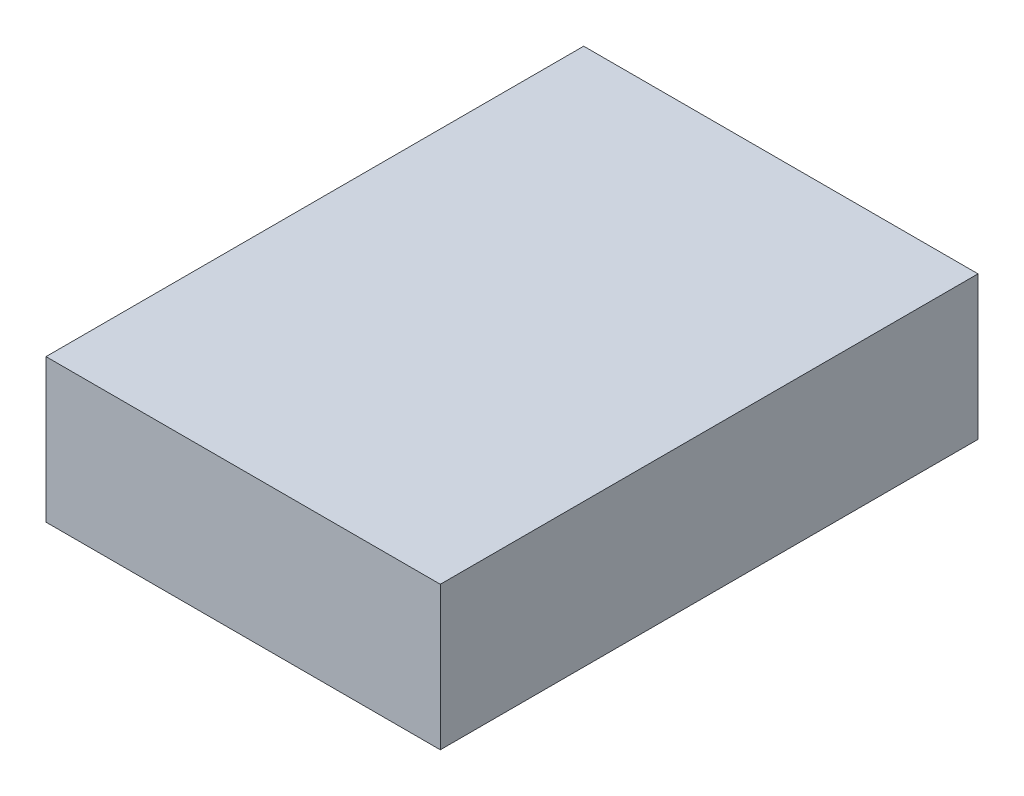
ISO-10303-21;
HEADER;
FILE_DESCRIPTION(('STEP AP214'),'2;1');
FILE_NAME('part.step','',(''),(''),'','','');
FILE_SCHEMA(('AUTOMOTIVE_DESIGN { 1 0 10303 214 1 1 1 1 }'));
ENDSEC;
DATA;
#1=APPLICATION_CONTEXT('core data for automotive mechanical design processes');
#2=APPLICATION_PROTOCOL_DEFINITION('international standard','automotive_design',2000,#1);
#3=PRODUCT_CONTEXT('',#1,'mechanical');
#4=PRODUCT('Part','Part','',(#3));
#5=PRODUCT_RELATED_PRODUCT_CATEGORY('part','',(#4));
#6=PRODUCT_DEFINITION_FORMATION('','',#4);
#7=PRODUCT_DEFINITION_CONTEXT('part definition',#1,'design');
#8=PRODUCT_DEFINITION('design','',#6,#7);
#9=PRODUCT_DEFINITION_SHAPE('','',#8);
#10=(LENGTH_UNIT() NAMED_UNIT(*) SI_UNIT(.MILLI.,.METRE.));
#11=(NAMED_UNIT(*) PLANE_ANGLE_UNIT() SI_UNIT($,.RADIAN.));
#12=(NAMED_UNIT(*) SI_UNIT($,.STERADIAN.) SOLID_ANGLE_UNIT());
#13=UNCERTAINTY_MEASURE_WITH_UNIT(LENGTH_MEASURE(1.E-05),#10,'distance_accuracy_value','');
#14=(GEOMETRIC_REPRESENTATION_CONTEXT(3) GLOBAL_UNCERTAINTY_ASSIGNED_CONTEXT((#13)) GLOBAL_UNIT_ASSIGNED_CONTEXT((#10,
#11,#12)) REPRESENTATION_CONTEXT('',''));
#15=CARTESIAN_POINT('',(0.,0.,0.));
#16=DIRECTION('',(0.,0.,1.));
#17=DIRECTION('',(1.,0.,0.));
#18=AXIS2_PLACEMENT_3D('',#15,#16,#17);
#19=CARTESIAN_POINT('',(0.,25.4,0.));
#20=DIRECTION('',(1.,0.,0.));
#21=DIRECTION('',(0.,0.,-1.));
#22=AXIS2_PLACEMENT_3D('',#19,#20,#21);
#23=PLANE('',#22);
#24=DIRECTION('',(0.,0.,1.));
#25=VECTOR('',#24,1.);
#26=CARTESIAN_POINT('',(0.,0.,0.));
#27=LINE('',#26,#25);
#28=CARTESIAN_POINT('',(0.,0.,-95.25));
#29=VERTEX_POINT('',#28);
#30=CARTESIAN_POINT('',(0.,0.,0.));
#31=VERTEX_POINT('',#30);
#32=EDGE_CURVE('E98',#29,#31,#27,.T.);
#33=ORIENTED_EDGE('',*,*,#32,.T.);
#34=DIRECTION('',(0.,-1.,0.));
#35=VECTOR('',#34,1.);
#36=CARTESIAN_POINT('',(0.,25.4,0.));
#37=LINE('',#36,#35);
#38=CARTESIAN_POINT('',(0.,25.4,0.));
#39=VERTEX_POINT('',#38);
#40=EDGE_CURVE('E11',#39,#31,#37,.T.);
#41=ORIENTED_EDGE('',*,*,#40,.F.);
#42=DIRECTION('',(0.,0.,1.));
#43=VECTOR('',#42,1.);
#44=CARTESIAN_POINT('',(0.,25.4,0.));
#45=LINE('',#44,#43);
#46=CARTESIAN_POINT('',(0.,25.4,-95.25));
#47=VERTEX_POINT('',#46);
#48=EDGE_CURVE('E86',#47,#39,#45,.T.);
#49=ORIENTED_EDGE('',*,*,#48,.F.);
#50=DIRECTION('',(0.,-1.,0.));
#51=VECTOR('',#50,1.);
#52=CARTESIAN_POINT('',(0.,25.4,-95.25));
#53=LINE('',#52,#51);
#54=EDGE_CURVE('E94',#47,#29,#53,.T.);
#55=ORIENTED_EDGE('',*,*,#54,.T.);
#56=EDGE_LOOP('',(#33,#41,#49,#55));
#57=FACE_BOUND('',#56,.T.);
#58=ADVANCED_FACE('F35',(#57),#23,.F.);
#59=CARTESIAN_POINT('',(0.,25.4,0.));
#60=DIRECTION('',(0.,0.,-1.));
#61=DIRECTION('',(-1.,0.,0.));
#62=AXIS2_PLACEMENT_3D('',#59,#60,#61);
#63=PLANE('',#62);
#64=DIRECTION('',(1.,0.,0.));
#65=VECTOR('',#64,1.);
#66=CARTESIAN_POINT('',(0.,0.,0.));
#67=LINE('',#66,#65);
#68=CARTESIAN_POINT('',(69.85,0.,0.));
#69=VERTEX_POINT('',#68);
#70=EDGE_CURVE('E90',#31,#69,#67,.T.);
#71=ORIENTED_EDGE('',*,*,#70,.T.);
#72=DIRECTION('',(0.,-1.,0.));
#73=VECTOR('',#72,1.);
#74=CARTESIAN_POINT('',(69.85,25.4,0.));
#75=LINE('',#74,#73);
#76=CARTESIAN_POINT('',(69.85,25.4,0.));
#77=VERTEX_POINT('',#76);
#78=EDGE_CURVE('E43',#77,#69,#75,.T.);
#79=ORIENTED_EDGE('',*,*,#78,.F.);
#80=DIRECTION('',(1.,0.,0.));
#81=VECTOR('',#80,1.);
#82=CARTESIAN_POINT('',(0.,25.4,0.));
#83=LINE('',#82,#81);
#84=EDGE_CURVE('E81',#39,#77,#83,.T.);
#85=ORIENTED_EDGE('',*,*,#84,.F.);
#86=ORIENTED_EDGE('',*,*,#40,.T.);
#87=EDGE_LOOP('',(#71,#79,#85,#86));
#88=FACE_BOUND('',#87,.T.);
#89=ADVANCED_FACE('F89',(#88),#63,.F.);
#90=CARTESIAN_POINT('',(69.85,25.4,0.));
#91=DIRECTION('',(-1.,0.,0.));
#92=DIRECTION('',(0.,0.,1.));
#93=AXIS2_PLACEMENT_3D('',#90,#91,#92);
#94=PLANE('',#93);
#95=DIRECTION('',(0.,0.,-1.));
#96=VECTOR('',#95,1.);
#97=CARTESIAN_POINT('',(69.85,0.,0.));
#98=LINE('',#97,#96);
#99=CARTESIAN_POINT('',(69.85,0.,-95.25));
#100=VERTEX_POINT('',#99);
#101=EDGE_CURVE('E68',#69,#100,#98,.T.);
#102=ORIENTED_EDGE('',*,*,#101,.T.);
#103=DIRECTION('',(0.,-1.,0.));
#104=VECTOR('',#103,1.);
#105=CARTESIAN_POINT('',(69.85,25.4,-95.25));
#106=LINE('',#105,#104);
#107=CARTESIAN_POINT('',(69.85,25.4,-95.25));
#108=VERTEX_POINT('',#107);
#109=EDGE_CURVE('E91',#108,#100,#106,.T.);
#110=ORIENTED_EDGE('',*,*,#109,.F.);
#111=DIRECTION('',(0.,0.,-1.));
#112=VECTOR('',#111,1.);
#113=CARTESIAN_POINT('',(69.85,25.4,0.));
#114=LINE('',#113,#112);
#115=EDGE_CURVE('E84',#77,#108,#114,.T.);
#116=ORIENTED_EDGE('',*,*,#115,.F.);
#117=ORIENTED_EDGE('',*,*,#78,.T.);
#118=EDGE_LOOP('',(#102,#110,#116,#117));
#119=FACE_BOUND('',#118,.T.);
#120=ADVANCED_FACE('F92',(#119),#94,.F.);
#121=CARTESIAN_POINT('',(0.,25.4,-95.25));
#122=DIRECTION('',(0.,0.,1.));
#123=DIRECTION('',(1.,0.,0.));
#124=AXIS2_PLACEMENT_3D('',#121,#122,#123);
#125=PLANE('',#124);
#126=DIRECTION('',(-1.,0.,0.));
#127=VECTOR('',#126,1.);
#128=CARTESIAN_POINT('',(0.,0.,-95.25));
#129=LINE('',#128,#127);
#130=EDGE_CURVE('E74',#100,#29,#129,.T.);
#131=ORIENTED_EDGE('',*,*,#130,.T.);
#132=ORIENTED_EDGE('',*,*,#54,.F.);
#133=DIRECTION('',(-1.,0.,0.));
#134=VECTOR('',#133,1.);
#135=CARTESIAN_POINT('',(0.,25.4,-95.25));
#136=LINE('',#135,#134);
#137=EDGE_CURVE('E51',#108,#47,#136,.T.);
#138=ORIENTED_EDGE('',*,*,#137,.F.);
#139=ORIENTED_EDGE('',*,*,#109,.T.);
#140=EDGE_LOOP('',(#131,#132,#138,#139));
#141=FACE_BOUND('',#140,.T.);
#142=ADVANCED_FACE('F105',(#141),#125,.F.);
#143=CARTESIAN_POINT('',(0.,25.4,0.));
#144=DIRECTION('',(0.,-1.,0.));
#145=DIRECTION('',(0.,0.,-1.));
#146=AXIS2_PLACEMENT_3D('',#143,#144,#145);
#147=PLANE('',#146);
#148=ORIENTED_EDGE('',*,*,#48,.T.);
#149=ORIENTED_EDGE('',*,*,#84,.T.);
#150=ORIENTED_EDGE('',*,*,#115,.T.);
#151=ORIENTED_EDGE('',*,*,#137,.T.);
#152=EDGE_LOOP('',(#148,#149,#150,#151));
#153=FACE_BOUND('',#152,.T.);
#154=ADVANCED_FACE('F82',(#153),#147,.F.);
#155=CARTESIAN_POINT('',(0.,0.,0.));
#156=DIRECTION('',(0.,-1.,0.));
#157=DIRECTION('',(0.,0.,-1.));
#158=AXIS2_PLACEMENT_3D('',#155,#156,#157);
#159=PLANE('',#158);
#160=ORIENTED_EDGE('',*,*,#32,.F.);
#161=ORIENTED_EDGE('',*,*,#130,.F.);
#162=ORIENTED_EDGE('',*,*,#101,.F.);
#163=ORIENTED_EDGE('',*,*,#70,.F.);
#164=EDGE_LOOP('',(#160,#161,#162,#163));
#165=FACE_BOUND('',#164,.T.);
#166=ADVANCED_FACE('F108',(#165),#159,.T.);
#167=CLOSED_SHELL('',(#58,#89,#120,#142,#154,#166));
#168=MANIFOLD_SOLID_BREP('B2',#167);
#169=ADVANCED_BREP_SHAPE_REPRESENTATION('',(#18,#168),#14);
#170=SHAPE_DEFINITION_REPRESENTATION(#9,#169);
ENDSEC;
END-ISO-10303-21;
